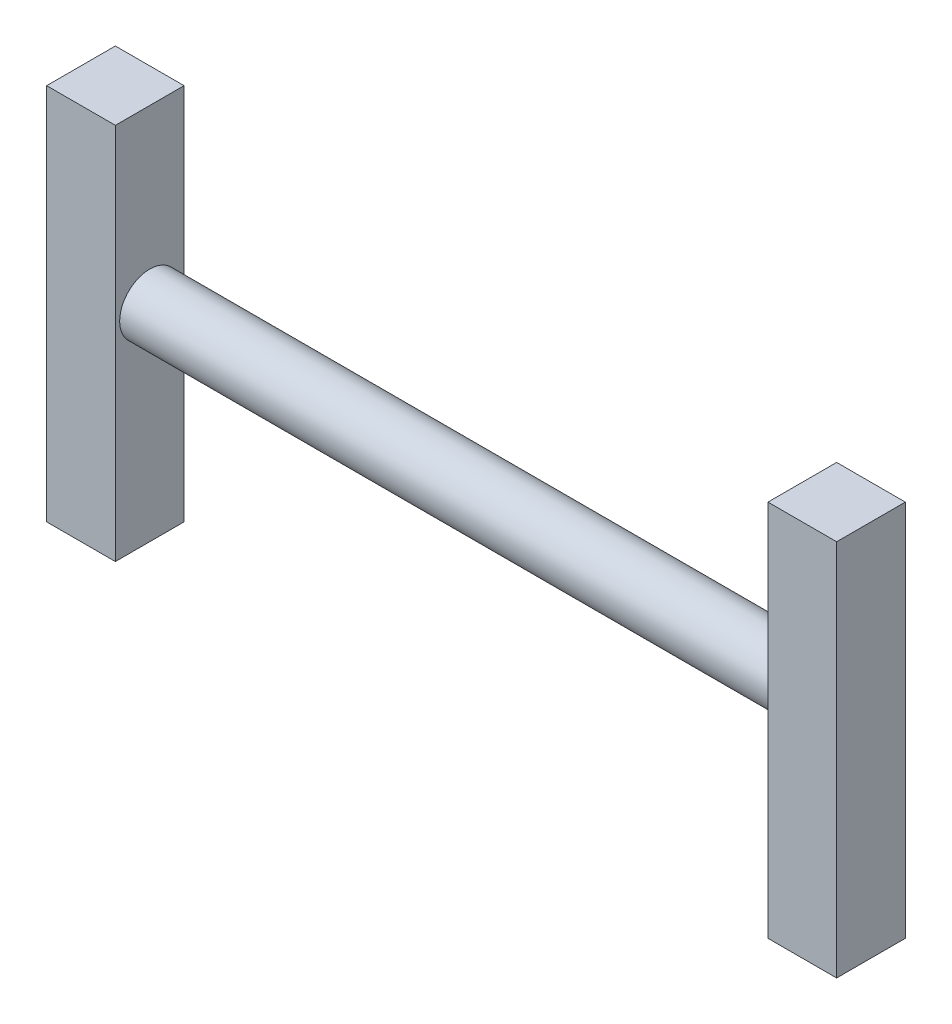
ISO-10303-21;
HEADER;
FILE_DESCRIPTION(('STEP AP214'),'2;1');
FILE_NAME('part.step','',(''),(''),'','','');
FILE_SCHEMA(('AUTOMOTIVE_DESIGN { 1 0 10303 214 1 1 1 1 }'));
ENDSEC;
DATA;
#1=APPLICATION_CONTEXT('core data for automotive mechanical design processes');
#2=APPLICATION_PROTOCOL_DEFINITION('international standard','automotive_design',2000,#1);
#3=PRODUCT_CONTEXT('',#1,'mechanical');
#4=PRODUCT('Part','Part','',(#3));
#5=PRODUCT_RELATED_PRODUCT_CATEGORY('part','',(#4));
#6=PRODUCT_DEFINITION_FORMATION('','',#4);
#7=PRODUCT_DEFINITION_CONTEXT('part definition',#1,'design');
#8=PRODUCT_DEFINITION('design','',#6,#7);
#9=PRODUCT_DEFINITION_SHAPE('','',#8);
#10=(LENGTH_UNIT() NAMED_UNIT(*) SI_UNIT(.MILLI.,.METRE.));
#11=(NAMED_UNIT(*) PLANE_ANGLE_UNIT() SI_UNIT($,.RADIAN.));
#12=(NAMED_UNIT(*) SI_UNIT($,.STERADIAN.) SOLID_ANGLE_UNIT());
#13=UNCERTAINTY_MEASURE_WITH_UNIT(LENGTH_MEASURE(1.E-05),#10,'distance_accuracy_value','');
#14=(GEOMETRIC_REPRESENTATION_CONTEXT(3) GLOBAL_UNCERTAINTY_ASSIGNED_CONTEXT((#13)) GLOBAL_UNIT_ASSIGNED_CONTEXT((#10,
#11,#12)) REPRESENTATION_CONTEXT('',''));
#15=CARTESIAN_POINT('',(0.,0.,0.));
#16=DIRECTION('',(0.,0.,1.));
#17=DIRECTION('',(1.,0.,0.));
#18=AXIS2_PLACEMENT_3D('',#15,#16,#17);
#19=CARTESIAN_POINT('',(20.,110.,20.));
#20=DIRECTION('',(-1.,0.,0.));
#21=DIRECTION('',(0.,0.,1.));
#22=AXIS2_PLACEMENT_3D('',#19,#20,#21);
#23=PLANE('',#22);
#24=CARTESIAN_POINT('',(20.,9.99999999999999,0.));
#25=DIRECTION('',(-1.,0.,0.));
#26=DIRECTION('',(0.,0.,1.));
#27=AXIS2_PLACEMENT_3D('',#24,#25,#26);
#28=CIRCLE('',#27,17.5);
#29=CARTESIAN_POINT('',(20.,9.99999999999999,17.5));
#30=VERTEX_POINT('',#29);
#31=EDGE_CURVE('E11',#30,#30,#28,.F.);
#32=ORIENTED_EDGE('',*,*,#31,.F.);
#33=EDGE_LOOP('',(#32));
#34=FACE_BOUND('',#33,.T.);
#35=DIRECTION('',(0.,0.,-1.));
#36=VECTOR('',#35,1.);
#37=CARTESIAN_POINT('',(20.,-110.,20.));
#38=LINE('',#37,#36);
#39=CARTESIAN_POINT('',(20.,-110.,20.));
#40=VERTEX_POINT('',#39);
#41=CARTESIAN_POINT('',(20.,-110.,-20.));
#42=VERTEX_POINT('',#41);
#43=EDGE_CURVE('E176',#40,#42,#38,.T.);
#44=ORIENTED_EDGE('',*,*,#43,.T.);
#45=DIRECTION('',(0.,-1.,0.));
#46=VECTOR('',#45,1.);
#47=CARTESIAN_POINT('',(20.,110.,-20.));
#48=LINE('',#47,#46);
#49=CARTESIAN_POINT('',(20.,110.,-20.));
#50=VERTEX_POINT('',#49);
#51=EDGE_CURVE('E50',#50,#42,#48,.T.);
#52=ORIENTED_EDGE('',*,*,#51,.F.);
#53=DIRECTION('',(0.,0.,-1.));
#54=VECTOR('',#53,1.);
#55=CARTESIAN_POINT('',(20.,110.,20.));
#56=LINE('',#55,#54);
#57=CARTESIAN_POINT('',(20.,110.,20.));
#58=VERTEX_POINT('',#57);
#59=EDGE_CURVE('E177',#58,#50,#56,.T.);
#60=ORIENTED_EDGE('',*,*,#59,.F.);
#61=DIRECTION('',(0.,-1.,0.));
#62=VECTOR('',#61,1.);
#63=CARTESIAN_POINT('',(20.,110.,20.));
#64=LINE('',#63,#62);
#65=EDGE_CURVE('E187',#58,#40,#64,.T.);
#66=ORIENTED_EDGE('',*,*,#65,.T.);
#67=EDGE_LOOP('',(#44,#52,#60,#66));
#68=FACE_BOUND('',#67,.T.);
#69=ADVANCED_FACE('F41',(#34,#68),#23,.F.);
#70=CARTESIAN_POINT('',(-20.,110.,-20.));
#71=DIRECTION('',(0.,0.,1.));
#72=DIRECTION('',(1.,0.,0.));
#73=AXIS2_PLACEMENT_3D('',#70,#71,#72);
#74=PLANE('',#73);
#75=DIRECTION('',(-1.,0.,0.));
#76=VECTOR('',#75,1.);
#77=CARTESIAN_POINT('',(-20.,-110.,-20.));
#78=LINE('',#77,#76);
#79=CARTESIAN_POINT('',(-20.,-110.,-20.));
#80=VERTEX_POINT('',#79);
#81=EDGE_CURVE('E191',#42,#80,#78,.T.);
#82=ORIENTED_EDGE('',*,*,#81,.T.);
#83=DIRECTION('',(0.,-1.,0.));
#84=VECTOR('',#83,1.);
#85=CARTESIAN_POINT('',(-20.,110.,-20.));
#86=LINE('',#85,#84);
#87=CARTESIAN_POINT('',(-20.,110.,-20.));
#88=VERTEX_POINT('',#87);
#89=EDGE_CURVE('E203',#88,#80,#86,.T.);
#90=ORIENTED_EDGE('',*,*,#89,.F.);
#91=DIRECTION('',(-1.,0.,0.));
#92=VECTOR('',#91,1.);
#93=CARTESIAN_POINT('',(-20.,110.,-20.));
#94=LINE('',#93,#92);
#95=EDGE_CURVE('E90',#50,#88,#94,.T.);
#96=ORIENTED_EDGE('',*,*,#95,.F.);
#97=ORIENTED_EDGE('',*,*,#51,.T.);
#98=EDGE_LOOP('',(#82,#90,#96,#97));
#99=FACE_BOUND('',#98,.T.);
#100=ADVANCED_FACE('F207',(#99),#74,.F.);
#101=CARTESIAN_POINT('',(-20.,110.,20.));
#102=DIRECTION('',(1.,0.,0.));
#103=DIRECTION('',(0.,0.,-1.));
#104=AXIS2_PLACEMENT_3D('',#101,#102,#103);
#105=PLANE('',#104);
#106=DIRECTION('',(0.,0.,1.));
#107=VECTOR('',#106,1.);
#108=CARTESIAN_POINT('',(-20.,-110.,20.));
#109=LINE('',#108,#107);
#110=CARTESIAN_POINT('',(-20.,-110.,20.));
#111=VERTEX_POINT('',#110);
#112=EDGE_CURVE('E76',#80,#111,#109,.T.);
#113=ORIENTED_EDGE('',*,*,#112,.T.);
#114=DIRECTION('',(0.,-1.,0.));
#115=VECTOR('',#114,1.);
#116=CARTESIAN_POINT('',(-20.,110.,20.));
#117=LINE('',#116,#115);
#118=CARTESIAN_POINT('',(-20.,110.,20.));
#119=VERTEX_POINT('',#118);
#120=EDGE_CURVE('E200',#119,#111,#117,.T.);
#121=ORIENTED_EDGE('',*,*,#120,.F.);
#122=DIRECTION('',(0.,0.,1.));
#123=VECTOR('',#122,1.);
#124=CARTESIAN_POINT('',(-20.,110.,20.));
#125=LINE('',#124,#123);
#126=EDGE_CURVE('E182',#88,#119,#125,.T.);
#127=ORIENTED_EDGE('',*,*,#126,.F.);
#128=ORIENTED_EDGE('',*,*,#89,.T.);
#129=EDGE_LOOP('',(#113,#121,#127,#128));
#130=FACE_BOUND('',#129,.T.);
#131=ADVANCED_FACE('F231',(#130),#105,.F.);
#132=CARTESIAN_POINT('',(-20.,110.,20.));
#133=DIRECTION('',(0.,0.,-1.));
#134=DIRECTION('',(-1.,0.,0.));
#135=AXIS2_PLACEMENT_3D('',#132,#133,#134);
#136=PLANE('',#135);
#137=DIRECTION('',(1.,0.,0.));
#138=VECTOR('',#137,1.);
#139=CARTESIAN_POINT('',(-20.,-110.,20.));
#140=LINE('',#139,#138);
#141=EDGE_CURVE('E82',#111,#40,#140,.T.);
#142=ORIENTED_EDGE('',*,*,#141,.T.);
#143=ORIENTED_EDGE('',*,*,#65,.F.);
#144=DIRECTION('',(1.,0.,0.));
#145=VECTOR('',#144,1.);
#146=CARTESIAN_POINT('',(-20.,110.,20.));
#147=LINE('',#146,#145);
#148=EDGE_CURVE('E58',#119,#58,#147,.T.);
#149=ORIENTED_EDGE('',*,*,#148,.F.);
#150=ORIENTED_EDGE('',*,*,#120,.T.);
#151=EDGE_LOOP('',(#142,#143,#149,#150));
#152=FACE_BOUND('',#151,.T.);
#153=ADVANCED_FACE('F223',(#152),#136,.F.);
#154=CARTESIAN_POINT('',(0.,110.,0.));
#155=DIRECTION('',(0.,-1.,0.));
#156=DIRECTION('',(0.,0.,-1.));
#157=AXIS2_PLACEMENT_3D('',#154,#155,#156);
#158=PLANE('',#157);
#159=ORIENTED_EDGE('',*,*,#59,.T.);
#160=ORIENTED_EDGE('',*,*,#95,.T.);
#161=ORIENTED_EDGE('',*,*,#126,.T.);
#162=ORIENTED_EDGE('',*,*,#148,.T.);
#163=EDGE_LOOP('',(#159,#160,#161,#162));
#164=FACE_BOUND('',#163,.T.);
#165=ADVANCED_FACE('F215',(#164),#158,.F.);
#166=CARTESIAN_POINT('',(0.,-110.,0.));
#167=DIRECTION('',(0.,-1.,0.));
#168=DIRECTION('',(0.,0.,-1.));
#169=AXIS2_PLACEMENT_3D('',#166,#167,#168);
#170=PLANE('',#169);
#171=ORIENTED_EDGE('',*,*,#43,.F.);
#172=ORIENTED_EDGE('',*,*,#141,.F.);
#173=ORIENTED_EDGE('',*,*,#112,.F.);
#174=ORIENTED_EDGE('',*,*,#81,.F.);
#175=EDGE_LOOP('',(#171,#172,#173,#174));
#176=FACE_BOUND('',#175,.T.);
#177=ADVANCED_FACE('F212',(#176),#170,.T.);
#178=CARTESIAN_POINT('',(210.,9.99999999999999,0.));
#179=DIRECTION('',(-1.,0.,0.));
#180=DIRECTION('',(0.,0.,1.));
#181=AXIS2_PLACEMENT_3D('',#178,#179,#180);
#182=CYLINDRICAL_SURFACE('',#181,17.5);
#183=ORIENTED_EDGE('',*,*,#31,.T.);
#184=EDGE_LOOP('',(#183));
#185=FACE_BOUND('',#184,.T.);
#186=CARTESIAN_POINT('',(400.,9.99999999999999,0.));
#187=DIRECTION('',(-1.,0.,0.));
#188=DIRECTION('',(0.,0.,1.));
#189=AXIS2_PLACEMENT_3D('',#186,#187,#188);
#190=CIRCLE('',#189,17.5);
#191=CARTESIAN_POINT('',(400.,9.99999999999999,17.5));
#192=VERTEX_POINT('',#191);
#193=EDGE_CURVE('E139',#192,#192,#190,.F.);
#194=ORIENTED_EDGE('',*,*,#193,.F.);
#195=EDGE_LOOP('',(#194));
#196=FACE_BOUND('',#195,.T.);
#197=ADVANCED_FACE('F214',(#185,#196),#182,.T.);
#198=CARTESIAN_POINT('',(400.,110.,20.));
#199=DIRECTION('',(1.,0.,0.));
#200=DIRECTION('',(0.,0.,1.));
#201=AXIS2_PLACEMENT_3D('',#198,#199,#200);
#202=PLANE('',#201);
#203=ORIENTED_EDGE('',*,*,#193,.T.);
#204=EDGE_LOOP('',(#203));
#205=FACE_BOUND('',#204,.T.);
#206=DIRECTION('',(0.,0.,-1.));
#207=VECTOR('',#206,1.);
#208=CARTESIAN_POINT('',(400.,-110.,20.));
#209=LINE('',#208,#207);
#210=CARTESIAN_POINT('',(400.,-110.,20.));
#211=VERTEX_POINT('',#210);
#212=CARTESIAN_POINT('',(400.,-110.,-20.));
#213=VERTEX_POINT('',#212);
#214=EDGE_CURVE('E157',#211,#213,#209,.T.);
#215=ORIENTED_EDGE('',*,*,#214,.F.);
#216=DIRECTION('',(0.,-1.,0.));
#217=VECTOR('',#216,1.);
#218=CARTESIAN_POINT('',(400.,110.,20.));
#219=LINE('',#218,#217);
#220=CARTESIAN_POINT('',(400.,110.,20.));
#221=VERTEX_POINT('',#220);
#222=EDGE_CURVE('E144',#221,#211,#219,.T.);
#223=ORIENTED_EDGE('',*,*,#222,.F.);
#224=DIRECTION('',(0.,0.,-1.));
#225=VECTOR('',#224,1.);
#226=CARTESIAN_POINT('',(400.,110.,20.));
#227=LINE('',#226,#225);
#228=CARTESIAN_POINT('',(400.,110.,-20.));
#229=VERTEX_POINT('',#228);
#230=EDGE_CURVE('E121',#221,#229,#227,.T.);
#231=ORIENTED_EDGE('',*,*,#230,.T.);
#232=DIRECTION('',(0.,-1.,0.));
#233=VECTOR('',#232,1.);
#234=CARTESIAN_POINT('',(400.,110.,-20.));
#235=LINE('',#234,#233);
#236=EDGE_CURVE('E131',#229,#213,#235,.T.);
#237=ORIENTED_EDGE('',*,*,#236,.T.);
#238=EDGE_LOOP('',(#215,#223,#231,#237));
#239=FACE_BOUND('',#238,.T.);
#240=ADVANCED_FACE('F142',(#205,#239),#202,.F.);
#241=CARTESIAN_POINT('',(440.,110.,-20.));
#242=DIRECTION('',(0.,0.,1.));
#243=DIRECTION('',(-1.,0.,0.));
#244=AXIS2_PLACEMENT_3D('',#241,#242,#243);
#245=PLANE('',#244);
#246=DIRECTION('',(1.,0.,0.));
#247=VECTOR('',#246,1.);
#248=CARTESIAN_POINT('',(440.,-110.,-20.));
#249=LINE('',#248,#247);
#250=CARTESIAN_POINT('',(440.,-110.,-20.));
#251=VERTEX_POINT('',#250);
#252=EDGE_CURVE('E134',#213,#251,#249,.T.);
#253=ORIENTED_EDGE('',*,*,#252,.F.);
#254=ORIENTED_EDGE('',*,*,#236,.F.);
#255=DIRECTION('',(1.,0.,0.));
#256=VECTOR('',#255,1.);
#257=CARTESIAN_POINT('',(440.,110.,-20.));
#258=LINE('',#257,#256);
#259=CARTESIAN_POINT('',(440.,110.,-20.));
#260=VERTEX_POINT('',#259);
#261=EDGE_CURVE('E117',#229,#260,#258,.T.);
#262=ORIENTED_EDGE('',*,*,#261,.T.);
#263=DIRECTION('',(0.,-1.,0.));
#264=VECTOR('',#263,1.);
#265=CARTESIAN_POINT('',(440.,110.,-20.));
#266=LINE('',#265,#264);
#267=EDGE_CURVE('E140',#260,#251,#266,.T.);
#268=ORIENTED_EDGE('',*,*,#267,.T.);
#269=EDGE_LOOP('',(#253,#254,#262,#268));
#270=FACE_BOUND('',#269,.T.);
#271=ADVANCED_FACE('F132',(#270),#245,.F.);
#272=CARTESIAN_POINT('',(440.,110.,20.));
#273=DIRECTION('',(-1.,0.,0.));
#274=DIRECTION('',(0.,0.,-1.));
#275=AXIS2_PLACEMENT_3D('',#272,#273,#274);
#276=PLANE('',#275);
#277=DIRECTION('',(0.,0.,1.));
#278=VECTOR('',#277,1.);
#279=CARTESIAN_POINT('',(440.,-110.,20.));
#280=LINE('',#279,#278);
#281=CARTESIAN_POINT('',(440.,-110.,20.));
#282=VERTEX_POINT('',#281);
#283=EDGE_CURVE('E149',#251,#282,#280,.T.);
#284=ORIENTED_EDGE('',*,*,#283,.F.);
#285=ORIENTED_EDGE('',*,*,#267,.F.);
#286=DIRECTION('',(0.,0.,1.));
#287=VECTOR('',#286,1.);
#288=CARTESIAN_POINT('',(440.,110.,20.));
#289=LINE('',#288,#287);
#290=CARTESIAN_POINT('',(440.,110.,20.));
#291=VERTEX_POINT('',#290);
#292=EDGE_CURVE('E124',#260,#291,#289,.T.);
#293=ORIENTED_EDGE('',*,*,#292,.T.);
#294=DIRECTION('',(0.,-1.,0.));
#295=VECTOR('',#294,1.);
#296=CARTESIAN_POINT('',(440.,110.,20.));
#297=LINE('',#296,#295);
#298=EDGE_CURVE('E167',#291,#282,#297,.T.);
#299=ORIENTED_EDGE('',*,*,#298,.T.);
#300=EDGE_LOOP('',(#284,#285,#293,#299));
#301=FACE_BOUND('',#300,.T.);
#302=ADVANCED_FACE('F241',(#301),#276,.F.);
#303=CARTESIAN_POINT('',(440.,110.,20.));
#304=DIRECTION('',(0.,0.,-1.));
#305=DIRECTION('',(1.,0.,0.));
#306=AXIS2_PLACEMENT_3D('',#303,#304,#305);
#307=PLANE('',#306);
#308=DIRECTION('',(-1.,0.,0.));
#309=VECTOR('',#308,1.);
#310=CARTESIAN_POINT('',(440.,-110.,20.));
#311=LINE('',#310,#309);
#312=EDGE_CURVE('E146',#282,#211,#311,.T.);
#313=ORIENTED_EDGE('',*,*,#312,.F.);
#314=ORIENTED_EDGE('',*,*,#298,.F.);
#315=DIRECTION('',(-1.,0.,0.));
#316=VECTOR('',#315,1.);
#317=CARTESIAN_POINT('',(440.,110.,20.));
#318=LINE('',#317,#316);
#319=EDGE_CURVE('E154',#291,#221,#318,.T.);
#320=ORIENTED_EDGE('',*,*,#319,.T.);
#321=ORIENTED_EDGE('',*,*,#222,.T.);
#322=EDGE_LOOP('',(#313,#314,#320,#321));
#323=FACE_BOUND('',#322,.T.);
#324=ADVANCED_FACE('F246',(#323),#307,.F.);
#325=CARTESIAN_POINT('',(420.,110.,0.));
#326=DIRECTION('',(0.,-1.,0.));
#327=DIRECTION('',(0.,0.,-1.));
#328=AXIS2_PLACEMENT_3D('',#325,#326,#327);
#329=PLANE('',#328);
#330=ORIENTED_EDGE('',*,*,#230,.F.);
#331=ORIENTED_EDGE('',*,*,#319,.F.);
#332=ORIENTED_EDGE('',*,*,#292,.F.);
#333=ORIENTED_EDGE('',*,*,#261,.F.);
#334=EDGE_LOOP('',(#330,#331,#332,#333));
#335=FACE_BOUND('',#334,.T.);
#336=ADVANCED_FACE('F119',(#335),#329,.F.);
#337=CARTESIAN_POINT('',(420.,-110.,0.));
#338=DIRECTION('',(0.,-1.,0.));
#339=DIRECTION('',(0.,0.,-1.));
#340=AXIS2_PLACEMENT_3D('',#337,#338,#339);
#341=PLANE('',#340);
#342=ORIENTED_EDGE('',*,*,#214,.T.);
#343=ORIENTED_EDGE('',*,*,#252,.T.);
#344=ORIENTED_EDGE('',*,*,#283,.T.);
#345=ORIENTED_EDGE('',*,*,#312,.T.);
#346=EDGE_LOOP('',(#342,#343,#344,#345));
#347=FACE_BOUND('',#346,.T.);
#348=ADVANCED_FACE('F251',(#347),#341,.T.);
#349=CLOSED_SHELL('',(#69,#100,#131,#153,#165,#177,#197,#240,#271,#302,#324,#336,#348));
#350=MANIFOLD_SOLID_BREP('B2',#349);
#351=ADVANCED_BREP_SHAPE_REPRESENTATION('',(#18,#350),#14);
#352=SHAPE_DEFINITION_REPRESENTATION(#9,#351);
ENDSEC;
END-ISO-10303-21;
